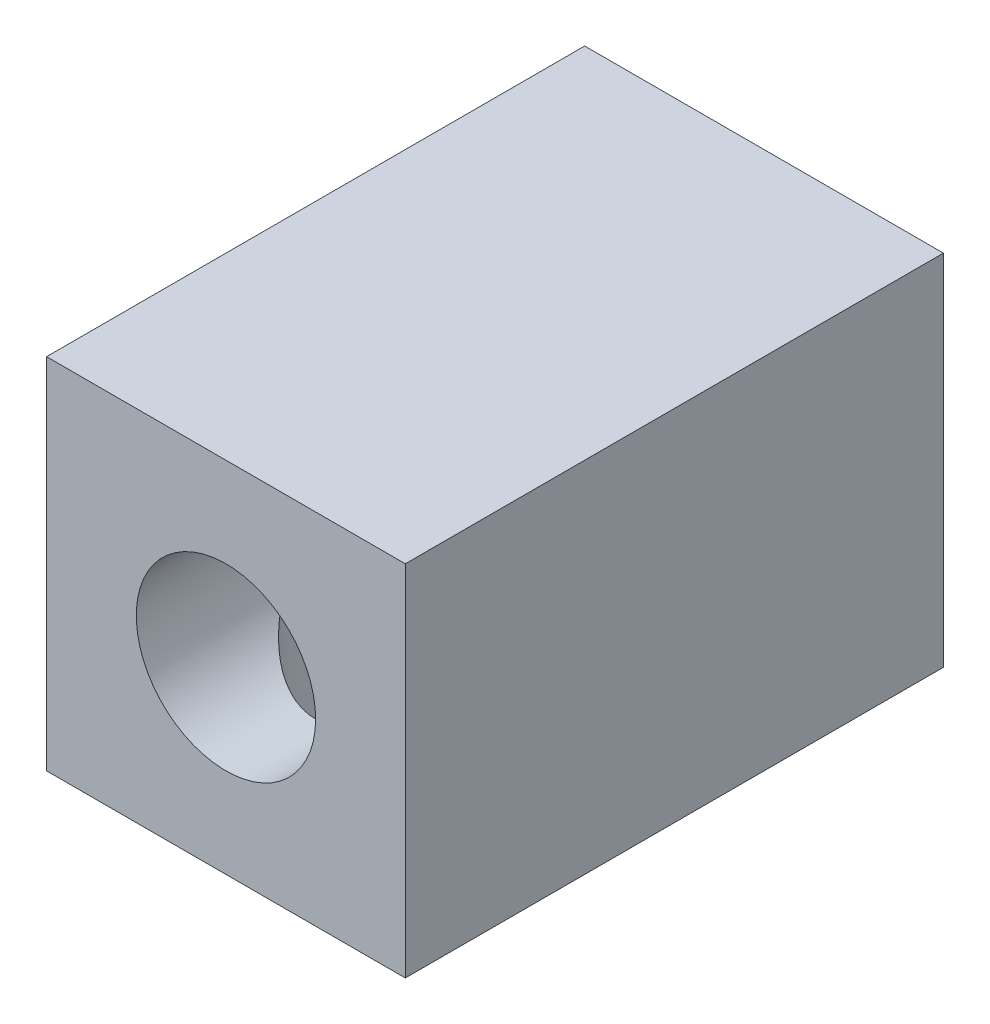
ISO-10303-21;
HEADER;
FILE_DESCRIPTION(('STEP AP214'),'2;1');
FILE_NAME('part.step','',(''),(''),'','','');
FILE_SCHEMA(('AUTOMOTIVE_DESIGN { 1 0 10303 214 1 1 1 1 }'));
ENDSEC;
DATA;
#1=APPLICATION_CONTEXT('core data for automotive mechanical design processes');
#2=APPLICATION_PROTOCOL_DEFINITION('international standard','automotive_design',2000,#1);
#3=PRODUCT_CONTEXT('',#1,'mechanical');
#4=PRODUCT('Part','Part','',(#3));
#5=PRODUCT_RELATED_PRODUCT_CATEGORY('part','',(#4));
#6=PRODUCT_DEFINITION_FORMATION('','',#4);
#7=PRODUCT_DEFINITION_CONTEXT('part definition',#1,'design');
#8=PRODUCT_DEFINITION('design','',#6,#7);
#9=PRODUCT_DEFINITION_SHAPE('','',#8);
#10=(LENGTH_UNIT() NAMED_UNIT(*) SI_UNIT(.MILLI.,.METRE.));
#11=(NAMED_UNIT(*) PLANE_ANGLE_UNIT() SI_UNIT($,.RADIAN.));
#12=(NAMED_UNIT(*) SI_UNIT($,.STERADIAN.) SOLID_ANGLE_UNIT());
#13=UNCERTAINTY_MEASURE_WITH_UNIT(LENGTH_MEASURE(1.E-05),#10,'distance_accuracy_value','');
#14=(GEOMETRIC_REPRESENTATION_CONTEXT(3) GLOBAL_UNCERTAINTY_ASSIGNED_CONTEXT((#13)) GLOBAL_UNIT_ASSIGNED_CONTEXT((#10,
#11,#12)) REPRESENTATION_CONTEXT('',''));
#15=CARTESIAN_POINT('',(0.,0.,0.));
#16=DIRECTION('',(0.,0.,1.));
#17=DIRECTION('',(1.,0.,0.));
#18=AXIS2_PLACEMENT_3D('',#15,#16,#17);
#19=CARTESIAN_POINT('',(-5.00000000000006,-5.00000000000023,15.0000000000004));
#20=DIRECTION('',(0.,0.,-0.999999999999999));
#21=DIRECTION('',(-1.,0.,0.));
#22=AXIS2_PLACEMENT_3D('',#19,#20,#21);
#23=PLANE('',#22);
#24=DIRECTION('',(0.,-1.00000000000001,0.));
#25=VECTOR('',#24,1.);
#26=CARTESIAN_POINT('',(-5.00000000000006,-5.00000000000023,15.0000000000004));
#27=LINE('',#26,#25);
#28=CARTESIAN_POINT('',(-5.00000000000034,5.00000000000012,15.0000000000002));
#29=VERTEX_POINT('',#28);
#30=CARTESIAN_POINT('',(-5.00000000000006,-5.00000000000023,15.0000000000004));
#31=VERTEX_POINT('',#30);
#32=EDGE_CURVE('E91',#29,#31,#27,.T.);
#33=ORIENTED_EDGE('',*,*,#32,.T.);
#34=DIRECTION('',(1.,0.,0.));
#35=VECTOR('',#34,1.);
#36=CARTESIAN_POINT('',(-5.00000000000006,-5.00000000000023,15.0000000000004));
#37=LINE('',#36,#35);
#38=CARTESIAN_POINT('',(4.99999999999984,-4.99999999999998,14.9999999999998));
#39=VERTEX_POINT('',#38);
#40=EDGE_CURVE('E93',#31,#39,#37,.T.);
#41=ORIENTED_EDGE('',*,*,#40,.T.);
#42=DIRECTION('',(0.,1.00000000000001,0.));
#43=VECTOR('',#42,1.);
#44=CARTESIAN_POINT('',(4.99999999999984,-4.99999999999998,14.9999999999998));
#45=LINE('',#44,#43);
#46=CARTESIAN_POINT('',(5.00000000000089,5.00000000000103,15.0000000000006));
#47=VERTEX_POINT('',#46);
#48=EDGE_CURVE('E95',#39,#47,#45,.T.);
#49=ORIENTED_EDGE('',*,*,#48,.T.);
#50=DIRECTION('',(-1.,0.,0.));
#51=VECTOR('',#50,1.);
#52=CARTESIAN_POINT('',(-5.00000000000034,5.00000000000012,15.0000000000002));
#53=LINE('',#52,#51);
#54=EDGE_CURVE('E36',#47,#29,#53,.T.);
#55=ORIENTED_EDGE('',*,*,#54,.T.);
#56=EDGE_LOOP('',(#33,#41,#49,#55));
#57=FACE_BOUND('',#56,.T.);
#58=CARTESIAN_POINT('',(4.9960036108132E-13,1.52655665885959E-12,15.0000000000005));
#59=DIRECTION('',(0.,0.,0.999999999999999));
#60=DIRECTION('',(1.,0.,0.));
#61=AXIS2_PLACEMENT_3D('',#58,#59,#60);
#62=CIRCLE('',#61,2.5);
#63=CARTESIAN_POINT('',(2.5000000000005,1.57211917095612E-12,15.0000000000005));
#64=VERTEX_POINT('',#63);
#65=EDGE_CURVE('E71',#64,#64,#62,.T.);
#66=ORIENTED_EDGE('',*,*,#65,.F.);
#67=EDGE_LOOP('',(#66));
#68=FACE_BOUND('',#67,.T.);
#69=ADVANCED_FACE('F16',(#57,#68),#23,.F.);
#70=CARTESIAN_POINT('',(-5.00000000000045,-4.99999999999995,-2.22044604925031E-13));
#71=DIRECTION('',(0.,0.,-0.999999999999999));
#72=DIRECTION('',(-1.,0.,0.));
#73=AXIS2_PLACEMENT_3D('',#70,#71,#72);
#74=PLANE('',#73);
#75=DIRECTION('',(0.,-1.00000000000001,0.));
#76=VECTOR('',#75,1.);
#77=CARTESIAN_POINT('',(-5.00000000000045,-4.99999999999995,-2.22044604925031E-13));
#78=LINE('',#77,#76);
#79=CARTESIAN_POINT('',(-5.00000000000034,4.99999999999998,2.77555756156289E-13));
#80=VERTEX_POINT('',#79);
#81=CARTESIAN_POINT('',(-5.00000000000045,-4.99999999999995,-2.22044604925031E-13));
#82=VERTEX_POINT('',#81);
#83=EDGE_CURVE('E78',#80,#82,#78,.T.);
#84=ORIENTED_EDGE('',*,*,#83,.F.);
#85=DIRECTION('',(-1.,0.,0.));
#86=VECTOR('',#85,1.);
#87=CARTESIAN_POINT('',(-5.00000000000034,4.99999999999998,2.77555756156289E-13));
#88=LINE('',#87,#86);
#89=CARTESIAN_POINT('',(4.99999999999978,5.00000000000003,4.44089209850063E-13));
#90=VERTEX_POINT('',#89);
#91=EDGE_CURVE('E89',#90,#80,#88,.T.);
#92=ORIENTED_EDGE('',*,*,#91,.F.);
#93=DIRECTION('',(0.,1.00000000000001,0.));
#94=VECTOR('',#93,1.);
#95=CARTESIAN_POINT('',(5.00000000000028,-4.99999999999834,4.44089209850063E-13));
#96=LINE('',#95,#94);
#97=CARTESIAN_POINT('',(5.00000000000028,-4.99999999999834,4.44089209850063E-13));
#98=VERTEX_POINT('',#97);
#99=EDGE_CURVE('E87',#98,#90,#96,.T.);
#100=ORIENTED_EDGE('',*,*,#99,.F.);
#101=DIRECTION('',(1.,0.,0.));
#102=VECTOR('',#101,1.);
#103=CARTESIAN_POINT('',(-5.00000000000045,-4.99999999999995,-2.22044604925031E-13));
#104=LINE('',#103,#102);
#105=EDGE_CURVE('E85',#82,#98,#104,.T.);
#106=ORIENTED_EDGE('',*,*,#105,.F.);
#107=EDGE_LOOP('',(#84,#92,#100,#106));
#108=FACE_BOUND('',#107,.T.);
#109=CARTESIAN_POINT('',(-1.11022302462516E-13,1.94289029309402E-13,0.));
#110=DIRECTION('',(0.,0.,0.999999999999999));
#111=DIRECTION('',(1.,0.,0.));
#112=AXIS2_PLACEMENT_3D('',#109,#110,#111);
#113=CIRCLE('',#112,2.5);
#114=CARTESIAN_POINT('',(2.49999999999989,2.39851541405933E-13,0.));
#115=VERTEX_POINT('',#114);
#116=EDGE_CURVE('E74',#115,#115,#113,.T.);
#117=ORIENTED_EDGE('',*,*,#116,.T.);
#118=EDGE_LOOP('',(#117));
#119=FACE_BOUND('',#118,.T.);
#120=ADVANCED_FACE('F117',(#108,#119),#74,.T.);
#121=CARTESIAN_POINT('',(-5.00000000000006,-5.00000000000023,15.0000000000004));
#122=DIRECTION('',(1.,0.,0.));
#123=DIRECTION('',(0.,0.,-0.999999999999999));
#124=AXIS2_PLACEMENT_3D('',#121,#122,#123);
#125=PLANE('',#124);
#126=ORIENTED_EDGE('',*,*,#83,.T.);
#127=DIRECTION('',(0.,0.,-0.999999999999999));
#128=VECTOR('',#127,1.);
#129=CARTESIAN_POINT('',(-5.00000000000006,-5.00000000000023,15.0000000000004));
#130=LINE('',#129,#128);
#131=EDGE_CURVE('E62',#31,#82,#130,.T.);
#132=ORIENTED_EDGE('',*,*,#131,.F.);
#133=ORIENTED_EDGE('',*,*,#32,.F.);
#134=DIRECTION('',(0.,0.,-0.999999999999999));
#135=VECTOR('',#134,1.);
#136=CARTESIAN_POINT('',(-5.00000000000034,5.00000000000012,15.0000000000002));
#137=LINE('',#136,#135);
#138=EDGE_CURVE('E98',#29,#80,#137,.T.);
#139=ORIENTED_EDGE('',*,*,#138,.T.);
#140=EDGE_LOOP('',(#126,#132,#133,#139));
#141=FACE_BOUND('',#140,.T.);
#142=ADVANCED_FACE('F18',(#141),#125,.F.);
#143=CARTESIAN_POINT('',(-5.00000000000006,-5.00000000000023,15.0000000000004));
#144=DIRECTION('',(0.,1.00000000000001,0.));
#145=DIRECTION('',(0.,0.,0.999999999999999));
#146=AXIS2_PLACEMENT_3D('',#143,#144,#145);
#147=PLANE('',#146);
#148=CARTESIAN_POINT('',(-3.33066907387547E-13,-5.00000000000014,9.99999999999945));
#149=DIRECTION('',(0.,1.00000000000001,0.));
#150=DIRECTION('',(0.,0.,0.999999999999999));
#151=AXIS2_PLACEMENT_3D('',#148,#149,#150);
#152=CIRCLE('',#151,2.5);
#153=CARTESIAN_POINT('',(-3.33084254622307E-13,-5.00000000000018,12.4999999999995));
#154=VERTEX_POINT('',#153);
#155=EDGE_CURVE('E76',#154,#154,#152,.T.);
#156=ORIENTED_EDGE('',*,*,#155,.T.);
#157=EDGE_LOOP('',(#156));
#158=FACE_BOUND('',#157,.T.);
#159=ORIENTED_EDGE('',*,*,#105,.T.);
#160=DIRECTION('',(0.,0.,-0.999999999999999));
#161=VECTOR('',#160,1.);
#162=CARTESIAN_POINT('',(4.99999999999984,-4.99999999999998,14.9999999999998));
#163=LINE('',#162,#161);
#164=EDGE_CURVE('E104',#39,#98,#163,.T.);
#165=ORIENTED_EDGE('',*,*,#164,.F.);
#166=ORIENTED_EDGE('',*,*,#40,.F.);
#167=ORIENTED_EDGE('',*,*,#131,.T.);
#168=EDGE_LOOP('',(#159,#165,#166,#167));
#169=FACE_BOUND('',#168,.T.);
#170=ADVANCED_FACE('F110',(#158,#169),#147,.F.);
#171=CARTESIAN_POINT('',(4.99999999999984,-4.99999999999998,14.9999999999998));
#172=DIRECTION('',(-1.,0.,0.));
#173=DIRECTION('',(0.,0.,0.999999999999999));
#174=AXIS2_PLACEMENT_3D('',#171,#172,#173);
#175=PLANE('',#174);
#176=ORIENTED_EDGE('',*,*,#99,.T.);
#177=DIRECTION('',(0.,0.,-0.999999999999999));
#178=VECTOR('',#177,1.);
#179=CARTESIAN_POINT('',(5.00000000000089,5.00000000000103,15.0000000000006));
#180=LINE('',#179,#178);
#181=EDGE_CURVE('E101',#47,#90,#180,.T.);
#182=ORIENTED_EDGE('',*,*,#181,.F.);
#183=ORIENTED_EDGE('',*,*,#48,.F.);
#184=ORIENTED_EDGE('',*,*,#164,.T.);
#185=EDGE_LOOP('',(#176,#182,#183,#184));
#186=FACE_BOUND('',#185,.T.);
#187=ADVANCED_FACE('F121',(#186),#175,.F.);
#188=CARTESIAN_POINT('',(-5.00000000000034,5.00000000000012,15.0000000000002));
#189=DIRECTION('',(0.,-1.00000000000001,0.));
#190=DIRECTION('',(1.,0.,0.));
#191=AXIS2_PLACEMENT_3D('',#188,#189,#190);
#192=PLANE('',#191);
#193=ORIENTED_EDGE('',*,*,#91,.T.);
#194=ORIENTED_EDGE('',*,*,#138,.F.);
#195=ORIENTED_EDGE('',*,*,#54,.F.);
#196=ORIENTED_EDGE('',*,*,#181,.T.);
#197=EDGE_LOOP('',(#193,#194,#195,#196));
#198=FACE_BOUND('',#197,.T.);
#199=ADVANCED_FACE('F66',(#198),#192,.F.);
#200=CARTESIAN_POINT('',(4.9960036108132E-13,1.52655665885959E-12,15.0000000000005));
#201=DIRECTION('',(0.,0.,-0.999999999999999));
#202=DIRECTION('',(-1.,0.,0.));
#203=AXIS2_PLACEMENT_3D('',#200,#201,#202);
#204=CYLINDRICAL_SURFACE('',#203,2.5);
#205=CARTESIAN_POINT('',(0.,0.,9.99999999999984));
#206=DIRECTION('',(0.,0.707106781186571,-0.707106781186563));
#207=DIRECTION('',(0.,-0.70710678118655,-0.707106781186537));
#208=AXIS2_PLACEMENT_3D('',#205,#206,#207);
#209=ELLIPSE('',#208,3.53553390593274,2.5);
#210=CARTESIAN_POINT('',(2.50000000000006,0.,10.0000000000001));
#211=VERTEX_POINT('',#210);
#212=CARTESIAN_POINT('',(-2.49999999999989,0.,9.9999999999999));
#213=VERTEX_POINT('',#212);
#214=EDGE_CURVE('E11',#211,#213,#209,.T.);
#215=ORIENTED_EDGE('',*,*,#214,.F.);
#216=CARTESIAN_POINT('',(0.,0.,9.99999999999984));
#217=DIRECTION('',(0.,-0.70710678118655,-0.707106781186537));
#218=DIRECTION('',(0.,0.707106781186571,-0.707106781186563));
#219=AXIS2_PLACEMENT_3D('',#216,#217,#218);
#220=ELLIPSE('',#219,3.53553390593274,2.5);
#221=EDGE_CURVE('E24',#213,#211,#220,.F.);
#222=ORIENTED_EDGE('',*,*,#221,.F.);
#223=EDGE_LOOP('',(#215,#222));
#224=FACE_BOUND('',#223,.T.);
#225=ORIENTED_EDGE('',*,*,#65,.T.);
#226=EDGE_LOOP('',(#225));
#227=FACE_BOUND('',#226,.T.);
#228=ORIENTED_EDGE('',*,*,#116,.F.);
#229=EDGE_LOOP('',(#228));
#230=FACE_BOUND('',#229,.T.);
#231=ADVANCED_FACE('F63',(#224,#227,#230),#204,.F.);
#232=CARTESIAN_POINT('',(-3.33066907387547E-13,-5.00000000000014,9.99999999999945));
#233=DIRECTION('',(0.,1.00000000000001,0.));
#234=DIRECTION('',(0.,0.,0.999999999999999));
#235=AXIS2_PLACEMENT_3D('',#232,#233,#234);
#236=CYLINDRICAL_SURFACE('',#235,2.5);
#237=ORIENTED_EDGE('',*,*,#214,.T.);
#238=ORIENTED_EDGE('',*,*,#221,.T.);
#239=EDGE_LOOP('',(#237,#238));
#240=FACE_BOUND('',#239,.T.);
#241=ORIENTED_EDGE('',*,*,#155,.F.);
#242=EDGE_LOOP('',(#241));
#243=FACE_BOUND('',#242,.T.);
#244=ADVANCED_FACE('F59',(#240,#243),#236,.F.);
#245=CLOSED_SHELL('',(#69,#120,#142,#170,#187,#199,#231,#244));
#246=MANIFOLD_SOLID_BREP('B1',#245);
#247=ADVANCED_BREP_SHAPE_REPRESENTATION('',(#18,#246),#14);
#248=SHAPE_DEFINITION_REPRESENTATION(#9,#247);
ENDSEC;
END-ISO-10303-21;
